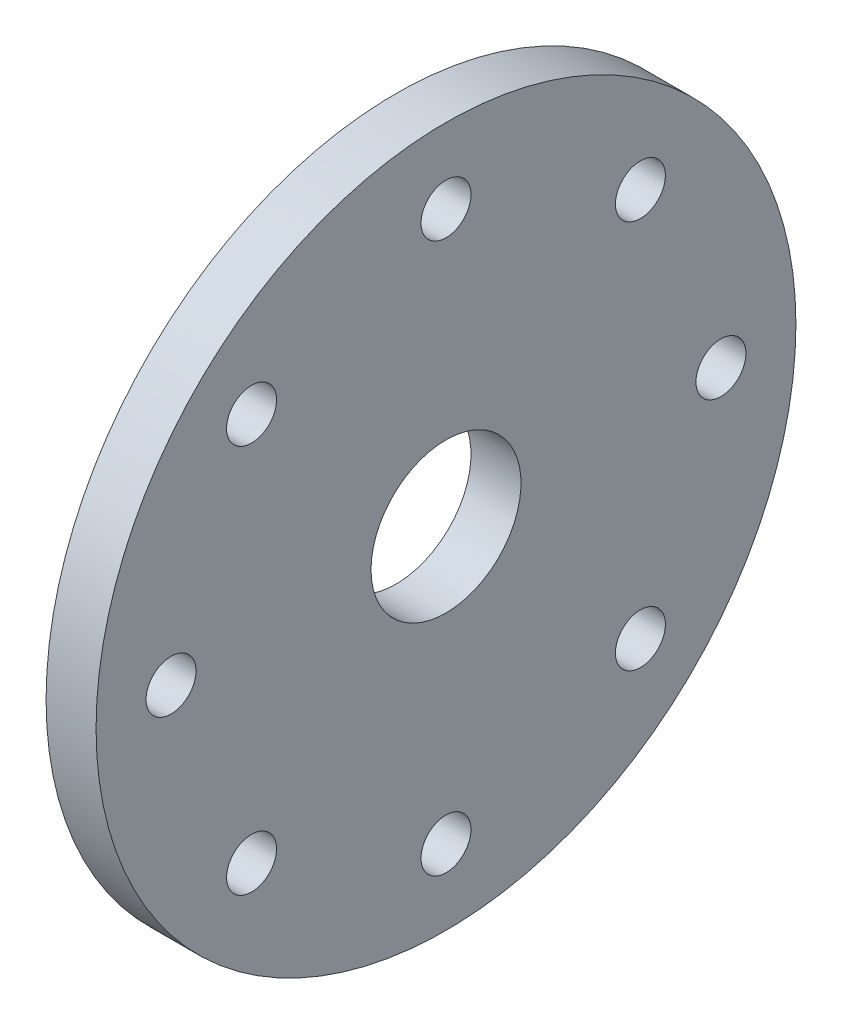
ISO-10303-21;
HEADER;
FILE_DESCRIPTION(('STEP AP214'),'2;1');
FILE_NAME('part.step','',(''),(''),'','','');
FILE_SCHEMA(('AUTOMOTIVE_DESIGN { 1 0 10303 214 1 1 1 1 }'));
ENDSEC;
DATA;
#1=APPLICATION_CONTEXT('core data for automotive mechanical design processes');
#2=APPLICATION_PROTOCOL_DEFINITION('international standard','automotive_design',2000,#1);
#3=PRODUCT_CONTEXT('',#1,'mechanical');
#4=PRODUCT('Part','Part','',(#3));
#5=PRODUCT_RELATED_PRODUCT_CATEGORY('part','',(#4));
#6=PRODUCT_DEFINITION_FORMATION('','',#4);
#7=PRODUCT_DEFINITION_CONTEXT('part definition',#1,'design');
#8=PRODUCT_DEFINITION('design','',#6,#7);
#9=PRODUCT_DEFINITION_SHAPE('','',#8);
#10=(LENGTH_UNIT() NAMED_UNIT(*) SI_UNIT(.MILLI.,.METRE.));
#11=(NAMED_UNIT(*) PLANE_ANGLE_UNIT() SI_UNIT($,.RADIAN.));
#12=(NAMED_UNIT(*) SI_UNIT($,.STERADIAN.) SOLID_ANGLE_UNIT());
#13=UNCERTAINTY_MEASURE_WITH_UNIT(LENGTH_MEASURE(1.E-05),#10,'distance_accuracy_value','');
#14=(GEOMETRIC_REPRESENTATION_CONTEXT(3) GLOBAL_UNCERTAINTY_ASSIGNED_CONTEXT((#13)) GLOBAL_UNIT_ASSIGNED_CONTEXT((#10,
#11,#12)) REPRESENTATION_CONTEXT('',''));
#15=CARTESIAN_POINT('',(0.,0.,0.));
#16=DIRECTION('',(0.,0.,1.));
#17=DIRECTION('',(1.,0.,0.));
#18=AXIS2_PLACEMENT_3D('',#15,#16,#17);
#19=CARTESIAN_POINT('',(-2.,3.,0.));
#20=DIRECTION('',(1.,0.,0.));
#21=DIRECTION('',(0.,0.,-1.));
#22=AXIS2_PLACEMENT_3D('',#19,#20,#21);
#23=PLANE('',#22);
#24=CARTESIAN_POINT('',(-2.,7.77817459305212,7.77817459305193));
#25=DIRECTION('',(1.,0.,0.));
#26=DIRECTION('',(0.,0.707106781186539,-0.707106781186556));
#27=AXIS2_PLACEMENT_3D('',#24,#25,#26);
#28=CIRCLE('',#27,1.);
#29=CARTESIAN_POINT('',(-2.,8.48528137423866,7.07106781186537));
#30=VERTEX_POINT('',#29);
#31=EDGE_CURVE('E73',#30,#30,#28,.T.);
#32=ORIENTED_EDGE('',*,*,#31,.T.);
#33=EDGE_LOOP('',(#32));
#34=FACE_BOUND('',#33,.T.);
#35=CARTESIAN_POINT('',(-2.,1.15218884181823E-13,11.));
#36=DIRECTION('',(1.,0.,0.));
#37=DIRECTION('',(0.,1.,0.));
#38=AXIS2_PLACEMENT_3D('',#35,#36,#37);
#39=CIRCLE('',#38,1.);
#40=CARTESIAN_POINT('',(-2.,1.00000000000012,11.));
#41=VERTEX_POINT('',#40);
#42=EDGE_CURVE('E67',#41,#41,#39,.T.);
#43=ORIENTED_EDGE('',*,*,#42,.T.);
#44=EDGE_LOOP('',(#43));
#45=FACE_BOUND('',#44,.T.);
#46=CARTESIAN_POINT('',(-2.,-7.77817459305195,7.77817459305209));
#47=DIRECTION('',(1.,0.,0.));
#48=DIRECTION('',(0.,0.707106781186554,0.707106781186541));
#49=AXIS2_PLACEMENT_3D('',#46,#47,#48);
#50=CIRCLE('',#49,1.);
#51=CARTESIAN_POINT('',(-2.,-7.0710678118654,8.48528137423863));
#52=VERTEX_POINT('',#51);
#53=EDGE_CURVE('E61',#52,#52,#50,.T.);
#54=ORIENTED_EDGE('',*,*,#53,.T.);
#55=EDGE_LOOP('',(#54));
#56=FACE_BOUND('',#55,.T.);
#57=CARTESIAN_POINT('',(-2.,-11.,0.));
#58=DIRECTION('',(1.,0.,0.));
#59=DIRECTION('',(0.,0.,1.));
#60=AXIS2_PLACEMENT_3D('',#57,#58,#59);
#61=CIRCLE('',#60,1.);
#62=CARTESIAN_POINT('',(-2.,-11.,1.));
#63=VERTEX_POINT('',#62);
#64=EDGE_CURVE('E55',#63,#63,#61,.T.);
#65=ORIENTED_EDGE('',*,*,#64,.T.);
#66=EDGE_LOOP('',(#65));
#67=FACE_BOUND('',#66,.T.);
#68=CARTESIAN_POINT('',(-2.,-7.77817459305206,-7.77817459305198));
#69=DIRECTION('',(1.,0.,0.));
#70=DIRECTION('',(0.,-0.707106781186544,0.707106781186551));
#71=AXIS2_PLACEMENT_3D('',#68,#69,#70);
#72=CIRCLE('',#71,1.);
#73=CARTESIAN_POINT('',(-2.,-8.48528137423861,-7.07106781186543));
#74=VERTEX_POINT('',#73);
#75=EDGE_CURVE('E49',#74,#74,#72,.T.);
#76=ORIENTED_EDGE('',*,*,#75,.T.);
#77=EDGE_LOOP('',(#76));
#78=FACE_BOUND('',#77,.T.);
#79=CARTESIAN_POINT('',(-2.,0.,-11.));
#80=DIRECTION('',(1.,0.,0.));
#81=DIRECTION('',(0.,-1.,0.));
#82=AXIS2_PLACEMENT_3D('',#79,#80,#81);
#83=CIRCLE('',#82,1.);
#84=CARTESIAN_POINT('',(-2.,-1.00000000000004,-11.));
#85=VERTEX_POINT('',#84);
#86=EDGE_CURVE('E43',#85,#85,#83,.T.);
#87=ORIENTED_EDGE('',*,*,#86,.T.);
#88=EDGE_LOOP('',(#87));
#89=FACE_BOUND('',#88,.T.);
#90=CARTESIAN_POINT('',(-2.,7.77817459305201,-7.77817459305204));
#91=DIRECTION('',(1.,0.,0.));
#92=DIRECTION('',(0.,-0.707106781186549,-0.707106781186546));
#93=AXIS2_PLACEMENT_3D('',#90,#91,#92);
#94=CIRCLE('',#93,1.);
#95=CARTESIAN_POINT('',(-2.,7.07106781186546,-8.48528137423859));
#96=VERTEX_POINT('',#95);
#97=EDGE_CURVE('E37',#96,#96,#94,.T.);
#98=ORIENTED_EDGE('',*,*,#97,.T.);
#99=EDGE_LOOP('',(#98));
#100=FACE_BOUND('',#99,.T.);
#101=CARTESIAN_POINT('',(-2.,11.,0.));
#102=DIRECTION('',(1.,0.,0.));
#103=DIRECTION('',(0.,0.,-1.));
#104=AXIS2_PLACEMENT_3D('',#101,#102,#103);
#105=CIRCLE('',#104,1.);
#106=CARTESIAN_POINT('',(-2.,11.,-1.));
#107=VERTEX_POINT('',#106);
#108=EDGE_CURVE('E33',#107,#107,#105,.T.);
#109=ORIENTED_EDGE('',*,*,#108,.T.);
#110=EDGE_LOOP('',(#109));
#111=FACE_BOUND('',#110,.T.);
#112=CARTESIAN_POINT('',(-2.,0.,0.));
#113=DIRECTION('',(-1.,0.,0.));
#114=DIRECTION('',(0.,0.,1.));
#115=AXIS2_PLACEMENT_3D('',#112,#113,#114);
#116=CIRCLE('',#115,3.);
#117=CARTESIAN_POINT('',(-2.,0.,3.));
#118=VERTEX_POINT('',#117);
#119=EDGE_CURVE('E28',#118,#118,#116,.T.);
#120=ORIENTED_EDGE('',*,*,#119,.F.);
#121=EDGE_LOOP('',(#120));
#122=FACE_BOUND('',#121,.T.);
#123=CARTESIAN_POINT('',(-2.,0.,0.));
#124=DIRECTION('',(-1.,0.,0.));
#125=DIRECTION('',(0.,0.,1.));
#126=AXIS2_PLACEMENT_3D('',#123,#124,#125);
#127=CIRCLE('',#126,14.);
#128=CARTESIAN_POINT('',(-2.,0.,14.));
#129=VERTEX_POINT('',#128);
#130=EDGE_CURVE('E10',#129,#129,#127,.T.);
#131=ORIENTED_EDGE('',*,*,#130,.T.);
#132=EDGE_LOOP('',(#131));
#133=FACE_BOUND('',#132,.T.);
#134=ADVANCED_FACE('F14',(#34,#45,#56,#67,#78,#89,#100,#111,#122,#133),#23,.F.);
#135=CARTESIAN_POINT('',(0.,0.,0.));
#136=DIRECTION('',(-1.,0.,0.));
#137=DIRECTION('',(0.,0.,1.));
#138=AXIS2_PLACEMENT_3D('',#135,#136,#137);
#139=CYLINDRICAL_SURFACE('',#138,14.);
#140=ORIENTED_EDGE('',*,*,#130,.F.);
#141=EDGE_LOOP('',(#140));
#142=FACE_BOUND('',#141,.T.);
#143=CARTESIAN_POINT('',(0.,0.,0.));
#144=DIRECTION('',(-1.,0.,0.));
#145=DIRECTION('',(0.,0.,1.));
#146=AXIS2_PLACEMENT_3D('',#143,#144,#145);
#147=CIRCLE('',#146,14.);
#148=CARTESIAN_POINT('',(0.,0.,14.));
#149=VERTEX_POINT('',#148);
#150=EDGE_CURVE('E20',#149,#149,#147,.T.);
#151=ORIENTED_EDGE('',*,*,#150,.T.);
#152=EDGE_LOOP('',(#151));
#153=FACE_BOUND('',#152,.T.);
#154=ADVANCED_FACE('F95',(#142,#153),#139,.T.);
#155=CARTESIAN_POINT('',(0.,14.,0.));
#156=DIRECTION('',(-1.,0.,0.));
#157=DIRECTION('',(0.,0.,1.));
#158=AXIS2_PLACEMENT_3D('',#155,#156,#157);
#159=PLANE('',#158);
#160=CARTESIAN_POINT('',(0.,7.77817459305212,7.77817459305193));
#161=DIRECTION('',(1.,0.,0.));
#162=DIRECTION('',(0.,0.707106781186539,-0.707106781186556));
#163=AXIS2_PLACEMENT_3D('',#160,#161,#162);
#164=CIRCLE('',#163,1.);
#165=CARTESIAN_POINT('',(0.,8.48528137423866,7.07106781186537));
#166=VERTEX_POINT('',#165);
#167=EDGE_CURVE('E76',#166,#166,#164,.T.);
#168=ORIENTED_EDGE('',*,*,#167,.F.);
#169=EDGE_LOOP('',(#168));
#170=FACE_BOUND('',#169,.T.);
#171=CARTESIAN_POINT('',(0.,1.15218884181823E-13,11.));
#172=DIRECTION('',(1.,0.,0.));
#173=DIRECTION('',(0.,1.,0.));
#174=AXIS2_PLACEMENT_3D('',#171,#172,#173);
#175=CIRCLE('',#174,1.);
#176=CARTESIAN_POINT('',(0.,1.00000000000012,11.));
#177=VERTEX_POINT('',#176);
#178=EDGE_CURVE('E70',#177,#177,#175,.T.);
#179=ORIENTED_EDGE('',*,*,#178,.F.);
#180=EDGE_LOOP('',(#179));
#181=FACE_BOUND('',#180,.T.);
#182=CARTESIAN_POINT('',(0.,-7.77817459305195,7.77817459305209));
#183=DIRECTION('',(1.,0.,0.));
#184=DIRECTION('',(0.,0.707106781186554,0.707106781186541));
#185=AXIS2_PLACEMENT_3D('',#182,#183,#184);
#186=CIRCLE('',#185,1.);
#187=CARTESIAN_POINT('',(0.,-7.0710678118654,8.48528137423863));
#188=VERTEX_POINT('',#187);
#189=EDGE_CURVE('E64',#188,#188,#186,.T.);
#190=ORIENTED_EDGE('',*,*,#189,.F.);
#191=EDGE_LOOP('',(#190));
#192=FACE_BOUND('',#191,.T.);
#193=CARTESIAN_POINT('',(0.,-11.,0.));
#194=DIRECTION('',(1.,0.,0.));
#195=DIRECTION('',(0.,0.,1.));
#196=AXIS2_PLACEMENT_3D('',#193,#194,#195);
#197=CIRCLE('',#196,1.);
#198=CARTESIAN_POINT('',(0.,-11.,1.));
#199=VERTEX_POINT('',#198);
#200=EDGE_CURVE('E58',#199,#199,#197,.T.);
#201=ORIENTED_EDGE('',*,*,#200,.F.);
#202=EDGE_LOOP('',(#201));
#203=FACE_BOUND('',#202,.T.);
#204=CARTESIAN_POINT('',(0.,-7.77817459305206,-7.77817459305198));
#205=DIRECTION('',(1.,0.,0.));
#206=DIRECTION('',(0.,-0.707106781186544,0.707106781186551));
#207=AXIS2_PLACEMENT_3D('',#204,#205,#206);
#208=CIRCLE('',#207,1.);
#209=CARTESIAN_POINT('',(0.,-8.48528137423861,-7.07106781186543));
#210=VERTEX_POINT('',#209);
#211=EDGE_CURVE('E52',#210,#210,#208,.T.);
#212=ORIENTED_EDGE('',*,*,#211,.F.);
#213=EDGE_LOOP('',(#212));
#214=FACE_BOUND('',#213,.T.);
#215=CARTESIAN_POINT('',(0.,0.,-11.));
#216=DIRECTION('',(1.,0.,0.));
#217=DIRECTION('',(0.,-1.,0.));
#218=AXIS2_PLACEMENT_3D('',#215,#216,#217);
#219=CIRCLE('',#218,1.);
#220=CARTESIAN_POINT('',(0.,-1.00000000000004,-11.));
#221=VERTEX_POINT('',#220);
#222=EDGE_CURVE('E46',#221,#221,#219,.T.);
#223=ORIENTED_EDGE('',*,*,#222,.F.);
#224=EDGE_LOOP('',(#223));
#225=FACE_BOUND('',#224,.T.);
#226=CARTESIAN_POINT('',(0.,7.77817459305201,-7.77817459305204));
#227=DIRECTION('',(1.,0.,0.));
#228=DIRECTION('',(0.,-0.707106781186549,-0.707106781186546));
#229=AXIS2_PLACEMENT_3D('',#226,#227,#228);
#230=CIRCLE('',#229,1.);
#231=CARTESIAN_POINT('',(0.,7.07106781186546,-8.48528137423859));
#232=VERTEX_POINT('',#231);
#233=EDGE_CURVE('E40',#232,#232,#230,.T.);
#234=ORIENTED_EDGE('',*,*,#233,.F.);
#235=EDGE_LOOP('',(#234));
#236=FACE_BOUND('',#235,.T.);
#237=CARTESIAN_POINT('',(0.,11.,0.));
#238=DIRECTION('',(1.,0.,0.));
#239=DIRECTION('',(0.,0.,-1.));
#240=AXIS2_PLACEMENT_3D('',#237,#238,#239);
#241=CIRCLE('',#240,1.);
#242=CARTESIAN_POINT('',(0.,11.,-1.));
#243=VERTEX_POINT('',#242);
#244=EDGE_CURVE('E34',#243,#243,#241,.T.);
#245=ORIENTED_EDGE('',*,*,#244,.F.);
#246=EDGE_LOOP('',(#245));
#247=FACE_BOUND('',#246,.T.);
#248=ORIENTED_EDGE('',*,*,#150,.F.);
#249=EDGE_LOOP('',(#248));
#250=FACE_BOUND('',#249,.T.);
#251=CARTESIAN_POINT('',(0.,0.,0.));
#252=DIRECTION('',(-1.,0.,0.));
#253=DIRECTION('',(0.,0.,1.));
#254=AXIS2_PLACEMENT_3D('',#251,#252,#253);
#255=CIRCLE('',#254,3.);
#256=CARTESIAN_POINT('',(0.,0.,3.));
#257=VERTEX_POINT('',#256);
#258=EDGE_CURVE('E24',#257,#257,#255,.T.);
#259=ORIENTED_EDGE('',*,*,#258,.T.);
#260=EDGE_LOOP('',(#259));
#261=FACE_BOUND('',#260,.T.);
#262=ADVANCED_FACE('F91',(#170,#181,#192,#203,#214,#225,#236,#247,#250,#261),#159,.F.);
#263=CARTESIAN_POINT('',(0.,0.,0.));
#264=DIRECTION('',(-1.,0.,0.));
#265=DIRECTION('',(0.,0.,1.));
#266=AXIS2_PLACEMENT_3D('',#263,#264,#265);
#267=CYLINDRICAL_SURFACE('',#266,3.);
#268=ORIENTED_EDGE('',*,*,#258,.F.);
#269=EDGE_LOOP('',(#268));
#270=FACE_BOUND('',#269,.T.);
#271=ORIENTED_EDGE('',*,*,#119,.T.);
#272=EDGE_LOOP('',(#271));
#273=FACE_BOUND('',#272,.T.);
#274=ADVANCED_FACE('F94',(#270,#273),#267,.F.);
#275=CARTESIAN_POINT('',(-2.,11.,0.));
#276=DIRECTION('',(1.,0.,0.));
#277=DIRECTION('',(0.,0.,-1.));
#278=AXIS2_PLACEMENT_3D('',#275,#276,#277);
#279=CYLINDRICAL_SURFACE('',#278,1.);
#280=ORIENTED_EDGE('',*,*,#108,.F.);
#281=EDGE_LOOP('',(#280));
#282=FACE_BOUND('',#281,.T.);
#283=ORIENTED_EDGE('',*,*,#244,.T.);
#284=EDGE_LOOP('',(#283));
#285=FACE_BOUND('',#284,.T.);
#286=ADVANCED_FACE('F116',(#282,#285),#279,.F.);
#287=CARTESIAN_POINT('',(-2.,7.77817459305201,-7.77817459305204));
#288=DIRECTION('',(1.,0.,0.));
#289=DIRECTION('',(0.,0.,-1.));
#290=AXIS2_PLACEMENT_3D('',#287,#288,#289);
#291=CYLINDRICAL_SURFACE('',#290,1.);
#292=ORIENTED_EDGE('',*,*,#97,.F.);
#293=EDGE_LOOP('',(#292));
#294=FACE_BOUND('',#293,.T.);
#295=ORIENTED_EDGE('',*,*,#233,.T.);
#296=EDGE_LOOP('',(#295));
#297=FACE_BOUND('',#296,.T.);
#298=ADVANCED_FACE('F131',(#294,#297),#291,.F.);
#299=CARTESIAN_POINT('',(-2.,0.,-11.));
#300=DIRECTION('',(1.,0.,0.));
#301=DIRECTION('',(0.,0.,-1.));
#302=AXIS2_PLACEMENT_3D('',#299,#300,#301);
#303=CYLINDRICAL_SURFACE('',#302,1.);
#304=ORIENTED_EDGE('',*,*,#86,.F.);
#305=EDGE_LOOP('',(#304));
#306=FACE_BOUND('',#305,.T.);
#307=ORIENTED_EDGE('',*,*,#222,.T.);
#308=EDGE_LOOP('',(#307));
#309=FACE_BOUND('',#308,.T.);
#310=ADVANCED_FACE('F135',(#306,#309),#303,.F.);
#311=CARTESIAN_POINT('',(-2.,-7.77817459305206,-7.77817459305198));
#312=DIRECTION('',(1.,0.,0.));
#313=DIRECTION('',(0.,0.,-1.));
#314=AXIS2_PLACEMENT_3D('',#311,#312,#313);
#315=CYLINDRICAL_SURFACE('',#314,1.);
#316=ORIENTED_EDGE('',*,*,#75,.F.);
#317=EDGE_LOOP('',(#316));
#318=FACE_BOUND('',#317,.T.);
#319=ORIENTED_EDGE('',*,*,#211,.T.);
#320=EDGE_LOOP('',(#319));
#321=FACE_BOUND('',#320,.T.);
#322=ADVANCED_FACE('F139',(#318,#321),#315,.F.);
#323=CARTESIAN_POINT('',(-2.,-11.,0.));
#324=DIRECTION('',(1.,0.,0.));
#325=DIRECTION('',(0.,0.,-1.));
#326=AXIS2_PLACEMENT_3D('',#323,#324,#325);
#327=CYLINDRICAL_SURFACE('',#326,1.);
#328=ORIENTED_EDGE('',*,*,#64,.F.);
#329=EDGE_LOOP('',(#328));
#330=FACE_BOUND('',#329,.T.);
#331=ORIENTED_EDGE('',*,*,#200,.T.);
#332=EDGE_LOOP('',(#331));
#333=FACE_BOUND('',#332,.T.);
#334=ADVANCED_FACE('F143',(#330,#333),#327,.F.);
#335=CARTESIAN_POINT('',(-2.,-7.77817459305195,7.77817459305209));
#336=DIRECTION('',(1.,0.,0.));
#337=DIRECTION('',(0.,0.,-1.));
#338=AXIS2_PLACEMENT_3D('',#335,#336,#337);
#339=CYLINDRICAL_SURFACE('',#338,1.);
#340=ORIENTED_EDGE('',*,*,#53,.F.);
#341=EDGE_LOOP('',(#340));
#342=FACE_BOUND('',#341,.T.);
#343=ORIENTED_EDGE('',*,*,#189,.T.);
#344=EDGE_LOOP('',(#343));
#345=FACE_BOUND('',#344,.T.);
#346=ADVANCED_FACE('F147',(#342,#345),#339,.F.);
#347=CARTESIAN_POINT('',(-2.,1.15218884181823E-13,11.));
#348=DIRECTION('',(1.,0.,0.));
#349=DIRECTION('',(0.,0.,-1.));
#350=AXIS2_PLACEMENT_3D('',#347,#348,#349);
#351=CYLINDRICAL_SURFACE('',#350,1.);
#352=ORIENTED_EDGE('',*,*,#42,.F.);
#353=EDGE_LOOP('',(#352));
#354=FACE_BOUND('',#353,.T.);
#355=ORIENTED_EDGE('',*,*,#178,.T.);
#356=EDGE_LOOP('',(#355));
#357=FACE_BOUND('',#356,.T.);
#358=ADVANCED_FACE('F87',(#354,#357),#351,.F.);
#359=CARTESIAN_POINT('',(-2.,7.77817459305212,7.77817459305193));
#360=DIRECTION('',(1.,0.,0.));
#361=DIRECTION('',(0.,0.,-1.));
#362=AXIS2_PLACEMENT_3D('',#359,#360,#361);
#363=CYLINDRICAL_SURFACE('',#362,1.);
#364=ORIENTED_EDGE('',*,*,#31,.F.);
#365=EDGE_LOOP('',(#364));
#366=FACE_BOUND('',#365,.T.);
#367=ORIENTED_EDGE('',*,*,#167,.T.);
#368=EDGE_LOOP('',(#367));
#369=FACE_BOUND('',#368,.T.);
#370=ADVANCED_FACE('F84',(#366,#369),#363,.F.);
#371=CLOSED_SHELL('',(#134,#154,#262,#274,#286,#298,#310,#322,#334,#346,#358,#370));
#372=MANIFOLD_SOLID_BREP('B1',#371);
#373=ADVANCED_BREP_SHAPE_REPRESENTATION('',(#18,#372),#14);
#374=SHAPE_DEFINITION_REPRESENTATION(#9,#373);
ENDSEC;
END-ISO-10303-21;
